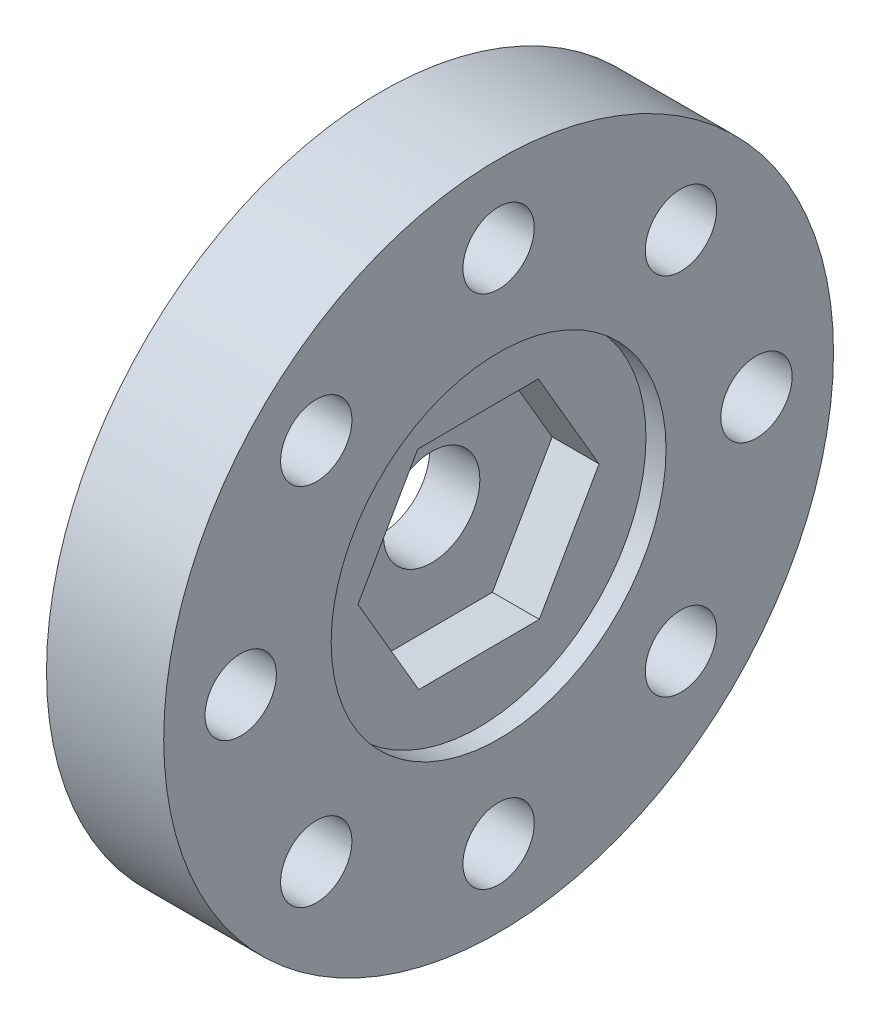
ISO-10303-21;
HEADER;
FILE_DESCRIPTION(('STEP AP214'),'2;1');
FILE_NAME('part.step','',(''),(''),'','','');
FILE_SCHEMA(('AUTOMOTIVE_DESIGN { 1 0 10303 214 1 1 1 1 }'));
ENDSEC;
DATA;
#1=APPLICATION_CONTEXT('core data for automotive mechanical design processes');
#2=APPLICATION_PROTOCOL_DEFINITION('international standard','automotive_design',2000,#1);
#3=PRODUCT_CONTEXT('',#1,'mechanical');
#4=PRODUCT('Part','Part','',(#3));
#5=PRODUCT_RELATED_PRODUCT_CATEGORY('part','',(#4));
#6=PRODUCT_DEFINITION_FORMATION('','',#4);
#7=PRODUCT_DEFINITION_CONTEXT('part definition',#1,'design');
#8=PRODUCT_DEFINITION('design','',#6,#7);
#9=PRODUCT_DEFINITION_SHAPE('','',#8);
#10=(LENGTH_UNIT() NAMED_UNIT(*) SI_UNIT(.MILLI.,.METRE.));
#11=(NAMED_UNIT(*) PLANE_ANGLE_UNIT() SI_UNIT($,.RADIAN.));
#12=(NAMED_UNIT(*) SI_UNIT($,.STERADIAN.) SOLID_ANGLE_UNIT());
#13=UNCERTAINTY_MEASURE_WITH_UNIT(LENGTH_MEASURE(1.E-05),#10,'distance_accuracy_value','');
#14=(GEOMETRIC_REPRESENTATION_CONTEXT(3) GLOBAL_UNCERTAINTY_ASSIGNED_CONTEXT((#13)) GLOBAL_UNIT_ASSIGNED_CONTEXT((#10,
#11,#12)) REPRESENTATION_CONTEXT('',''));
#15=CARTESIAN_POINT('',(0.,0.,0.));
#16=DIRECTION('',(0.,0.,1.));
#17=DIRECTION('',(1.,0.,0.));
#18=AXIS2_PLACEMENT_3D('',#15,#16,#17);
#19=CARTESIAN_POINT('',(4.445,0.,0.));
#20=DIRECTION('',(1.,0.,0.));
#21=DIRECTION('',(0.,0.,-1.));
#22=AXIS2_PLACEMENT_3D('',#19,#20,#21);
#23=PLANE('',#22);
#24=CARTESIAN_POINT('',(4.445,0.,0.));
#25=DIRECTION('',(1.,0.,0.));
#26=DIRECTION('',(0.,0.,-1.));
#27=AXIS2_PLACEMENT_3D('',#24,#25,#26);
#28=CIRCLE('',#27,6.35);
#29=CARTESIAN_POINT('',(4.445,0.,-6.35));
#30=VERTEX_POINT('',#29);
#31=EDGE_CURVE('E136',#30,#30,#28,.T.);
#32=ORIENTED_EDGE('',*,*,#31,.F.);
#33=EDGE_LOOP('',(#32));
#34=FACE_BOUND('',#33,.T.);
#35=CARTESIAN_POINT('',(4.445,-4.16903844779881E-13,9.77899999999958));
#36=DIRECTION('',(1.,0.,0.));
#37=DIRECTION('',(0.,0.,-1.));
#38=AXIS2_PLACEMENT_3D('',#35,#36,#37);
#39=CIRCLE('',#38,1.35255000000062);
#40=CARTESIAN_POINT('',(4.445,-4.16903844779881E-13,8.42644999999897));
#41=VERTEX_POINT('',#40);
#42=EDGE_CURVE('E154',#41,#41,#39,.T.);
#43=ORIENTED_EDGE('',*,*,#42,.F.);
#44=EDGE_LOOP('',(#43));
#45=FACE_BOUND('',#44,.T.);
#46=CARTESIAN_POINT('',(4.445,-9.779,-8.31770244680021E-13));
#47=DIRECTION('',(1.,0.,0.));
#48=DIRECTION('',(0.,0.,-1.));
#49=AXIS2_PLACEMENT_3D('',#46,#47,#48);
#50=CIRCLE('',#49,1.35255000000086);
#51=CARTESIAN_POINT('',(4.445,-9.779,-1.35255000000169));
#52=VERTEX_POINT('',#51);
#53=EDGE_CURVE('E166',#52,#52,#50,.T.);
#54=ORIENTED_EDGE('',*,*,#53,.F.);
#55=EDGE_LOOP('',(#54));
#56=FACE_BOUND('',#55,.T.);
#57=CARTESIAN_POINT('',(4.445,4.15706262674995E-13,-9.77900000000041));
#58=DIRECTION('',(1.,0.,0.));
#59=DIRECTION('',(0.,0.,-1.));
#60=AXIS2_PLACEMENT_3D('',#57,#58,#59);
#61=CIRCLE('',#60,1.35255000000031);
#62=CARTESIAN_POINT('',(4.445,4.15706262674995E-13,-11.1315500000007));
#63=VERTEX_POINT('',#62);
#64=EDGE_CURVE('E178',#63,#63,#61,.T.);
#65=ORIENTED_EDGE('',*,*,#64,.F.);
#66=EDGE_LOOP('',(#65));
#67=FACE_BOUND('',#66,.T.);
#68=CARTESIAN_POINT('',(4.445,9.779,0.));
#69=DIRECTION('',(1.,0.,0.));
#70=DIRECTION('',(0.,0.,-1.));
#71=AXIS2_PLACEMENT_3D('',#68,#69,#70);
#72=CIRCLE('',#71,1.35255);
#73=CARTESIAN_POINT('',(4.445,9.779,-1.35255));
#74=VERTEX_POINT('',#73);
#75=EDGE_CURVE('E190',#74,#74,#72,.T.);
#76=ORIENTED_EDGE('',*,*,#75,.F.);
#77=EDGE_LOOP('',(#76));
#78=FACE_BOUND('',#77,.T.);
#79=CARTESIAN_POINT('',(4.445,0.,0.));
#80=DIRECTION('',(1.,0.,0.));
#81=DIRECTION('',(0.,0.,-1.));
#82=AXIS2_PLACEMENT_3D('',#79,#80,#81);
#83=CIRCLE('',#82,12.7);
#84=CARTESIAN_POINT('',(4.445,0.,-12.7));
#85=VERTEX_POINT('',#84);
#86=EDGE_CURVE('E11',#85,#85,#83,.T.);
#87=ORIENTED_EDGE('',*,*,#86,.T.);
#88=EDGE_LOOP('',(#87));
#89=FACE_BOUND('',#88,.T.);
#90=CARTESIAN_POINT('',(4.445,6.91479721322354,-6.91479721322337));
#91=DIRECTION('',(1.,0.,0.));
#92=DIRECTION('',(0.,0.,-1.));
#93=AXIS2_PLACEMENT_3D('',#90,#91,#92);
#94=CIRCLE('',#93,1.35255000000005);
#95=CARTESIAN_POINT('',(4.445,6.91479721322354,-8.26734721322342));
#96=VERTEX_POINT('',#95);
#97=EDGE_CURVE('E184',#96,#96,#94,.T.);
#98=ORIENTED_EDGE('',*,*,#97,.F.);
#99=EDGE_LOOP('',(#98));
#100=FACE_BOUND('',#99,.T.);
#101=CARTESIAN_POINT('',(4.445,-6.91479721322295,-6.91479721322396));
#102=DIRECTION('',(1.,0.,0.));
#103=DIRECTION('',(0.,0.,-1.));
#104=AXIS2_PLACEMENT_3D('',#101,#102,#103);
#105=CIRCLE('',#104,1.35255000000064);
#106=CARTESIAN_POINT('',(4.445,-6.91479721322295,-8.2673472132246));
#107=VERTEX_POINT('',#106);
#108=EDGE_CURVE('E172',#107,#107,#105,.T.);
#109=ORIENTED_EDGE('',*,*,#108,.F.);
#110=EDGE_LOOP('',(#109));
#111=FACE_BOUND('',#110,.T.);
#112=CARTESIAN_POINT('',(4.445,-6.91479721322354,6.91479721322254));
#113=DIRECTION('',(1.,0.,0.));
#114=DIRECTION('',(0.,0.,-1.));
#115=AXIS2_PLACEMENT_3D('',#112,#113,#114);
#116=CIRCLE('',#115,1.35255000000085);
#117=CARTESIAN_POINT('',(4.445,-6.91479721322354,5.56224721322169));
#118=VERTEX_POINT('',#117);
#119=EDGE_CURVE('E160',#118,#118,#116,.T.);
#120=ORIENTED_EDGE('',*,*,#119,.F.);
#121=EDGE_LOOP('',(#120));
#122=FACE_BOUND('',#121,.T.);
#123=CARTESIAN_POINT('',(4.445,6.91479721322295,6.91479721322313));
#124=DIRECTION('',(1.,0.,0.));
#125=DIRECTION('',(0.,0.,-1.));
#126=AXIS2_PLACEMENT_3D('',#123,#124,#125);
#127=CIRCLE('',#126,1.35255000000032);
#128=CARTESIAN_POINT('',(4.445,6.91479721322295,5.56224721322281));
#129=VERTEX_POINT('',#128);
#130=EDGE_CURVE('E148',#129,#129,#127,.T.);
#131=ORIENTED_EDGE('',*,*,#130,.F.);
#132=EDGE_LOOP('',(#131));
#133=FACE_BOUND('',#132,.T.);
#134=ADVANCED_FACE('F33',(#34,#45,#56,#67,#78,#89,#100,#111,#122,#133),#23,.T.);
#135=CARTESIAN_POINT('',(0.,0.,0.));
#136=DIRECTION('',(1.,0.,0.));
#137=DIRECTION('',(0.,0.,-1.));
#138=AXIS2_PLACEMENT_3D('',#135,#136,#137);
#139=PLANE('',#138);
#140=CARTESIAN_POINT('',(0.,0.,0.));
#141=DIRECTION('',(1.,0.,0.));
#142=DIRECTION('',(0.,0.,-1.));
#143=AXIS2_PLACEMENT_3D('',#140,#141,#142);
#144=CIRCLE('',#143,1.8288);
#145=CARTESIAN_POINT('',(0.,0.,-1.8288));
#146=VERTEX_POINT('',#145);
#147=EDGE_CURVE('E123',#146,#146,#144,.T.);
#148=ORIENTED_EDGE('',*,*,#147,.T.);
#149=EDGE_LOOP('',(#148));
#150=FACE_BOUND('',#149,.T.);
#151=CARTESIAN_POINT('',(0.,-4.16903844779881E-13,9.77899999999958));
#152=DIRECTION('',(1.,0.,0.));
#153=DIRECTION('',(0.,0.,-1.));
#154=AXIS2_PLACEMENT_3D('',#151,#152,#153);
#155=CIRCLE('',#154,1.35255000000062);
#156=CARTESIAN_POINT('',(0.,-4.16903844779881E-13,8.42644999999897));
#157=VERTEX_POINT('',#156);
#158=EDGE_CURVE('E151',#157,#157,#155,.T.);
#159=ORIENTED_EDGE('',*,*,#158,.T.);
#160=EDGE_LOOP('',(#159));
#161=FACE_BOUND('',#160,.T.);
#162=CARTESIAN_POINT('',(0.,-9.779,-8.31770244680021E-13));
#163=DIRECTION('',(1.,0.,0.));
#164=DIRECTION('',(0.,0.,-1.));
#165=AXIS2_PLACEMENT_3D('',#162,#163,#164);
#166=CIRCLE('',#165,1.35255000000086);
#167=CARTESIAN_POINT('',(0.,-9.779,-1.35255000000169));
#168=VERTEX_POINT('',#167);
#169=EDGE_CURVE('E163',#168,#168,#166,.T.);
#170=ORIENTED_EDGE('',*,*,#169,.T.);
#171=EDGE_LOOP('',(#170));
#172=FACE_BOUND('',#171,.T.);
#173=CARTESIAN_POINT('',(0.,4.15706262674995E-13,-9.77900000000041));
#174=DIRECTION('',(1.,0.,0.));
#175=DIRECTION('',(0.,0.,-1.));
#176=AXIS2_PLACEMENT_3D('',#173,#174,#175);
#177=CIRCLE('',#176,1.35255000000031);
#178=CARTESIAN_POINT('',(0.,4.15706262674995E-13,-11.1315500000007));
#179=VERTEX_POINT('',#178);
#180=EDGE_CURVE('E175',#179,#179,#177,.T.);
#181=ORIENTED_EDGE('',*,*,#180,.T.);
#182=EDGE_LOOP('',(#181));
#183=FACE_BOUND('',#182,.T.);
#184=CARTESIAN_POINT('',(0.,9.779,0.));
#185=DIRECTION('',(1.,0.,0.));
#186=DIRECTION('',(0.,0.,-1.));
#187=AXIS2_PLACEMENT_3D('',#184,#185,#186);
#188=CIRCLE('',#187,1.35255);
#189=CARTESIAN_POINT('',(0.,9.779,-1.35255));
#190=VERTEX_POINT('',#189);
#191=EDGE_CURVE('E187',#190,#190,#188,.T.);
#192=ORIENTED_EDGE('',*,*,#191,.T.);
#193=EDGE_LOOP('',(#192));
#194=FACE_BOUND('',#193,.T.);
#195=CARTESIAN_POINT('',(0.,0.,0.));
#196=DIRECTION('',(1.,0.,0.));
#197=DIRECTION('',(0.,0.,-1.));
#198=AXIS2_PLACEMENT_3D('',#195,#196,#197);
#199=CIRCLE('',#198,12.7);
#200=CARTESIAN_POINT('',(0.,0.,-12.7));
#201=VERTEX_POINT('',#200);
#202=EDGE_CURVE('E37',#201,#201,#199,.T.);
#203=ORIENTED_EDGE('',*,*,#202,.F.);
#204=EDGE_LOOP('',(#203));
#205=FACE_BOUND('',#204,.T.);
#206=CARTESIAN_POINT('',(0.,6.91479721322354,-6.91479721322337));
#207=DIRECTION('',(1.,0.,0.));
#208=DIRECTION('',(0.,0.,-1.));
#209=AXIS2_PLACEMENT_3D('',#206,#207,#208);
#210=CIRCLE('',#209,1.35255000000005);
#211=CARTESIAN_POINT('',(0.,6.91479721322354,-8.26734721322342));
#212=VERTEX_POINT('',#211);
#213=EDGE_CURVE('E181',#212,#212,#210,.T.);
#214=ORIENTED_EDGE('',*,*,#213,.T.);
#215=EDGE_LOOP('',(#214));
#216=FACE_BOUND('',#215,.T.);
#217=CARTESIAN_POINT('',(0.,-6.91479721322295,-6.91479721322396));
#218=DIRECTION('',(1.,0.,0.));
#219=DIRECTION('',(0.,0.,-1.));
#220=AXIS2_PLACEMENT_3D('',#217,#218,#219);
#221=CIRCLE('',#220,1.35255000000064);
#222=CARTESIAN_POINT('',(0.,-6.91479721322295,-8.2673472132246));
#223=VERTEX_POINT('',#222);
#224=EDGE_CURVE('E169',#223,#223,#221,.T.);
#225=ORIENTED_EDGE('',*,*,#224,.T.);
#226=EDGE_LOOP('',(#225));
#227=FACE_BOUND('',#226,.T.);
#228=CARTESIAN_POINT('',(0.,-6.91479721322354,6.91479721322254));
#229=DIRECTION('',(1.,0.,0.));
#230=DIRECTION('',(0.,0.,-1.));
#231=AXIS2_PLACEMENT_3D('',#228,#229,#230);
#232=CIRCLE('',#231,1.35255000000085);
#233=CARTESIAN_POINT('',(0.,-6.91479721322354,5.56224721322169));
#234=VERTEX_POINT('',#233);
#235=EDGE_CURVE('E157',#234,#234,#232,.T.);
#236=ORIENTED_EDGE('',*,*,#235,.T.);
#237=EDGE_LOOP('',(#236));
#238=FACE_BOUND('',#237,.T.);
#239=CARTESIAN_POINT('',(0.,6.91479721322295,6.91479721322313));
#240=DIRECTION('',(1.,0.,0.));
#241=DIRECTION('',(0.,0.,-1.));
#242=AXIS2_PLACEMENT_3D('',#239,#240,#241);
#243=CIRCLE('',#242,1.35255000000032);
#244=CARTESIAN_POINT('',(0.,6.91479721322295,5.56224721322281));
#245=VERTEX_POINT('',#244);
#246=EDGE_CURVE('E145',#245,#245,#243,.T.);
#247=ORIENTED_EDGE('',*,*,#246,.T.);
#248=EDGE_LOOP('',(#247));
#249=FACE_BOUND('',#248,.T.);
#250=ADVANCED_FACE('F196',(#150,#161,#172,#183,#194,#205,#216,#227,#238,#249),#139,.F.);
#251=CARTESIAN_POINT('',(4.445,0.,0.));
#252=DIRECTION('',(-1.,0.,0.));
#253=DIRECTION('',(0.,0.,1.));
#254=AXIS2_PLACEMENT_3D('',#251,#252,#253);
#255=CYLINDRICAL_SURFACE('',#254,12.7);
#256=ORIENTED_EDGE('',*,*,#86,.F.);
#257=EDGE_LOOP('',(#256));
#258=FACE_BOUND('',#257,.T.);
#259=ORIENTED_EDGE('',*,*,#202,.T.);
#260=EDGE_LOOP('',(#259));
#261=FACE_BOUND('',#260,.T.);
#262=ADVANCED_FACE('F35',(#258,#261),#255,.T.);
#263=CARTESIAN_POINT('',(4.445,9.779,0.));
#264=DIRECTION('',(-1.,0.,0.));
#265=DIRECTION('',(0.,0.,1.));
#266=AXIS2_PLACEMENT_3D('',#263,#264,#265);
#267=CYLINDRICAL_SURFACE('',#266,1.35255);
#268=ORIENTED_EDGE('',*,*,#75,.T.);
#269=EDGE_LOOP('',(#268));
#270=FACE_BOUND('',#269,.T.);
#271=ORIENTED_EDGE('',*,*,#191,.F.);
#272=EDGE_LOOP('',(#271));
#273=FACE_BOUND('',#272,.T.);
#274=ADVANCED_FACE('F199',(#270,#273),#267,.F.);
#275=CARTESIAN_POINT('',(4.445,6.91479721322354,-6.91479721322337));
#276=DIRECTION('',(-1.,0.,0.));
#277=DIRECTION('',(0.,0.,1.));
#278=AXIS2_PLACEMENT_3D('',#275,#276,#277);
#279=CYLINDRICAL_SURFACE('',#278,1.35255000000005);
#280=ORIENTED_EDGE('',*,*,#97,.T.);
#281=EDGE_LOOP('',(#280));
#282=FACE_BOUND('',#281,.T.);
#283=ORIENTED_EDGE('',*,*,#213,.F.);
#284=EDGE_LOOP('',(#283));
#285=FACE_BOUND('',#284,.T.);
#286=ADVANCED_FACE('F201',(#282,#285),#279,.F.);
#287=CARTESIAN_POINT('',(4.445,4.15706262674995E-13,-9.77900000000041));
#288=DIRECTION('',(-1.,0.,0.));
#289=DIRECTION('',(0.,0.,1.));
#290=AXIS2_PLACEMENT_3D('',#287,#288,#289);
#291=CYLINDRICAL_SURFACE('',#290,1.35255000000031);
#292=ORIENTED_EDGE('',*,*,#64,.T.);
#293=EDGE_LOOP('',(#292));
#294=FACE_BOUND('',#293,.T.);
#295=ORIENTED_EDGE('',*,*,#180,.F.);
#296=EDGE_LOOP('',(#295));
#297=FACE_BOUND('',#296,.T.);
#298=ADVANCED_FACE('F208',(#294,#297),#291,.F.);
#299=CARTESIAN_POINT('',(4.445,-6.91479721322295,-6.91479721322396));
#300=DIRECTION('',(-1.,0.,0.));
#301=DIRECTION('',(0.,0.,1.));
#302=AXIS2_PLACEMENT_3D('',#299,#300,#301);
#303=CYLINDRICAL_SURFACE('',#302,1.35255000000064);
#304=ORIENTED_EDGE('',*,*,#108,.T.);
#305=EDGE_LOOP('',(#304));
#306=FACE_BOUND('',#305,.T.);
#307=ORIENTED_EDGE('',*,*,#224,.F.);
#308=EDGE_LOOP('',(#307));
#309=FACE_BOUND('',#308,.T.);
#310=ADVANCED_FACE('F265',(#306,#309),#303,.F.);
#311=CARTESIAN_POINT('',(4.445,-9.779,-8.31770244680021E-13));
#312=DIRECTION('',(-1.,0.,0.));
#313=DIRECTION('',(0.,0.,1.));
#314=AXIS2_PLACEMENT_3D('',#311,#312,#313);
#315=CYLINDRICAL_SURFACE('',#314,1.35255000000086);
#316=ORIENTED_EDGE('',*,*,#53,.T.);
#317=EDGE_LOOP('',(#316));
#318=FACE_BOUND('',#317,.T.);
#319=ORIENTED_EDGE('',*,*,#169,.F.);
#320=EDGE_LOOP('',(#319));
#321=FACE_BOUND('',#320,.T.);
#322=ADVANCED_FACE('F261',(#318,#321),#315,.F.);
#323=CARTESIAN_POINT('',(4.445,-6.91479721322354,6.91479721322254));
#324=DIRECTION('',(-1.,0.,0.));
#325=DIRECTION('',(0.,0.,1.));
#326=AXIS2_PLACEMENT_3D('',#323,#324,#325);
#327=CYLINDRICAL_SURFACE('',#326,1.35255000000085);
#328=ORIENTED_EDGE('',*,*,#119,.T.);
#329=EDGE_LOOP('',(#328));
#330=FACE_BOUND('',#329,.T.);
#331=ORIENTED_EDGE('',*,*,#235,.F.);
#332=EDGE_LOOP('',(#331));
#333=FACE_BOUND('',#332,.T.);
#334=ADVANCED_FACE('F254',(#330,#333),#327,.F.);
#335=CARTESIAN_POINT('',(4.445,-4.16903844779881E-13,9.77899999999958));
#336=DIRECTION('',(-1.,0.,0.));
#337=DIRECTION('',(0.,0.,1.));
#338=AXIS2_PLACEMENT_3D('',#335,#336,#337);
#339=CYLINDRICAL_SURFACE('',#338,1.35255000000062);
#340=ORIENTED_EDGE('',*,*,#42,.T.);
#341=EDGE_LOOP('',(#340));
#342=FACE_BOUND('',#341,.T.);
#343=ORIENTED_EDGE('',*,*,#158,.F.);
#344=EDGE_LOOP('',(#343));
#345=FACE_BOUND('',#344,.T.);
#346=ADVANCED_FACE('F243',(#342,#345),#339,.F.);
#347=CARTESIAN_POINT('',(4.445,6.91479721322295,6.91479721322313));
#348=DIRECTION('',(-1.,0.,0.));
#349=DIRECTION('',(0.,0.,1.));
#350=AXIS2_PLACEMENT_3D('',#347,#348,#349);
#351=CYLINDRICAL_SURFACE('',#350,1.35255000000032);
#352=ORIENTED_EDGE('',*,*,#130,.T.);
#353=EDGE_LOOP('',(#352));
#354=FACE_BOUND('',#353,.T.);
#355=ORIENTED_EDGE('',*,*,#246,.F.);
#356=EDGE_LOOP('',(#355));
#357=FACE_BOUND('',#356,.T.);
#358=ADVANCED_FACE('F239',(#354,#357),#351,.F.);
#359=CARTESIAN_POINT('',(3.683,0.,0.));
#360=DIRECTION('',(1.,0.,0.));
#361=DIRECTION('',(0.,0.,-1.));
#362=AXIS2_PLACEMENT_3D('',#359,#360,#361);
#363=CYLINDRICAL_SURFACE('',#362,6.35);
#364=CARTESIAN_POINT('',(3.683,0.,0.));
#365=DIRECTION('',(1.,0.,0.));
#366=DIRECTION('',(0.,0.,-1.));
#367=AXIS2_PLACEMENT_3D('',#364,#365,#366);
#368=CIRCLE('',#367,6.35);
#369=CARTESIAN_POINT('',(3.683,0.,-6.35));
#370=VERTEX_POINT('',#369);
#371=EDGE_CURVE('E142',#370,#370,#368,.T.);
#372=ORIENTED_EDGE('',*,*,#371,.F.);
#373=EDGE_LOOP('',(#372));
#374=FACE_BOUND('',#373,.T.);
#375=ORIENTED_EDGE('',*,*,#31,.T.);
#376=EDGE_LOOP('',(#375));
#377=FACE_BOUND('',#376,.T.);
#378=ADVANCED_FACE('F242',(#374,#377),#363,.F.);
#379=CARTESIAN_POINT('',(3.683,0.,0.));
#380=DIRECTION('',(1.,0.,0.));
#381=DIRECTION('',(0.,0.,-1.));
#382=AXIS2_PLACEMENT_3D('',#379,#380,#381);
#383=PLANE('',#382);
#384=DIRECTION('',(0.,-0.00496429053464109,0.999987677833826));
#385=VECTOR('',#384,1.);
#386=CARTESIAN_POINT('',(3.683,3.97076772504019,-2.26631588128822));
#387=LINE('',#386,#385);
#388=CARTESIAN_POINT('',(3.683,3.97076772504019,-2.26631588128822));
#389=VERTEX_POINT('',#388);
#390=CARTESIAN_POINT('',(3.683,3.94807098871581,2.30562778176804));
#391=VERTEX_POINT('',#390);
#392=EDGE_CURVE('E48',#389,#391,#387,.T.);
#393=ORIENTED_EDGE('',*,*,#392,.F.);
#394=DIRECTION('',(0.,0.863532587208182,0.504293040631678));
#395=VECTOR('',#394,1.);
#396=CARTESIAN_POINT('',(3.683,0.0226967363243776,-4.57194366305625));
#397=LINE('',#396,#395);
#398=CARTESIAN_POINT('',(3.683,0.0226967363243776,-4.57194366305625));
#399=VERTEX_POINT('',#398);
#400=EDGE_CURVE('E132',#399,#389,#397,.T.);
#401=ORIENTED_EDGE('',*,*,#400,.F.);
#402=DIRECTION('',(0.,0.868496877742823,-0.495694637202147));
#403=VECTOR('',#402,1.);
#404=CARTESIAN_POINT('',(3.683,-3.94807098871581,-2.30562778176804));
#405=LINE('',#404,#403);
#406=CARTESIAN_POINT('',(3.683,-3.94807098871581,-2.30562778176804));
#407=VERTEX_POINT('',#406);
#408=EDGE_CURVE('E130',#407,#399,#405,.T.);
#409=ORIENTED_EDGE('',*,*,#408,.F.);
#410=DIRECTION('',(0.,0.00496429053464128,-0.999987677833826));
#411=VECTOR('',#410,1.);
#412=CARTESIAN_POINT('',(3.683,-3.97076772504019,2.26631588128822));
#413=LINE('',#412,#411);
#414=CARTESIAN_POINT('',(3.683,-3.97076772504019,2.26631588128822));
#415=VERTEX_POINT('',#414);
#416=EDGE_CURVE('E96',#415,#407,#413,.T.);
#417=ORIENTED_EDGE('',*,*,#416,.F.);
#418=DIRECTION('',(0.,-0.863532587208182,-0.504293040631679));
#419=VECTOR('',#418,1.);
#420=CARTESIAN_POINT('',(3.683,-0.0226967363243789,4.57194366305625));
#421=LINE('',#420,#419);
#422=CARTESIAN_POINT('',(3.683,-0.0226967363243789,4.57194366305625));
#423=VERTEX_POINT('',#422);
#424=EDGE_CURVE('E126',#423,#415,#421,.T.);
#425=ORIENTED_EDGE('',*,*,#424,.F.);
#426=DIRECTION('',(0.,-0.868496877742823,0.495694637202147));
#427=VECTOR('',#426,1.);
#428=CARTESIAN_POINT('',(3.683,3.94807098871581,2.30562778176804));
#429=LINE('',#428,#427);
#430=EDGE_CURVE('E122',#391,#423,#429,.T.);
#431=ORIENTED_EDGE('',*,*,#430,.F.);
#432=EDGE_LOOP('',(#393,#401,#409,#417,#425,#431));
#433=FACE_BOUND('',#432,.T.);
#434=ORIENTED_EDGE('',*,*,#371,.T.);
#435=EDGE_LOOP('',(#434));
#436=FACE_BOUND('',#435,.T.);
#437=ADVANCED_FACE('F251',(#433,#436),#383,.T.);
#438=CARTESIAN_POINT('',(1.905,3.97076772504019,-2.26631588128822));
#439=DIRECTION('',(0.,0.999987677833826,0.00496429053464109));
#440=DIRECTION('',(0.,-0.00496429053464109,0.999987677833826));
#441=AXIS2_PLACEMENT_3D('',#438,#439,#440);
#442=PLANE('',#441);
#443=ORIENTED_EDGE('',*,*,#392,.T.);
#444=DIRECTION('',(1.,0.,0.));
#445=VECTOR('',#444,1.);
#446=CARTESIAN_POINT('',(1.905,3.94807098871581,2.30562778176804));
#447=LINE('',#446,#445);
#448=CARTESIAN_POINT('',(1.905,3.94807098871581,2.30562778176804));
#449=VERTEX_POINT('',#448);
#450=EDGE_CURVE('E78',#449,#391,#447,.T.);
#451=ORIENTED_EDGE('',*,*,#450,.F.);
#452=DIRECTION('',(0.,-0.00496429053464109,0.999987677833826));
#453=VECTOR('',#452,1.);
#454=CARTESIAN_POINT('',(1.905,3.97076772504019,-2.26631588128822));
#455=LINE('',#454,#453);
#456=CARTESIAN_POINT('',(1.905,3.97076772504019,-2.26631588128822));
#457=VERTEX_POINT('',#456);
#458=EDGE_CURVE('E134',#457,#449,#455,.T.);
#459=ORIENTED_EDGE('',*,*,#458,.F.);
#460=DIRECTION('',(1.,0.,0.));
#461=VECTOR('',#460,1.);
#462=CARTESIAN_POINT('',(1.905,3.97076772504019,-2.26631588128822));
#463=LINE('',#462,#461);
#464=EDGE_CURVE('E56',#457,#389,#463,.T.);
#465=ORIENTED_EDGE('',*,*,#464,.T.);
#466=EDGE_LOOP('',(#443,#451,#459,#465));
#467=FACE_BOUND('',#466,.T.);
#468=ADVANCED_FACE('F319',(#467),#442,.F.);
#469=CARTESIAN_POINT('',(1.905,0.0226967363243776,-4.57194366305625));
#470=DIRECTION('',(0.,0.504293040631678,-0.863532587208182));
#471=DIRECTION('',(0.,0.863532587208182,0.504293040631678));
#472=AXIS2_PLACEMENT_3D('',#469,#470,#471);
#473=PLANE('',#472);
#474=ORIENTED_EDGE('',*,*,#400,.T.);
#475=ORIENTED_EDGE('',*,*,#464,.F.);
#476=DIRECTION('',(0.,0.863532587208182,0.504293040631678));
#477=VECTOR('',#476,1.);
#478=CARTESIAN_POINT('',(1.905,0.0226967363243776,-4.57194366305625));
#479=LINE('',#478,#477);
#480=CARTESIAN_POINT('',(1.905,0.0226967363243776,-4.57194366305625));
#481=VERTEX_POINT('',#480);
#482=EDGE_CURVE('E108',#481,#457,#479,.T.);
#483=ORIENTED_EDGE('',*,*,#482,.F.);
#484=DIRECTION('',(1.,0.,0.));
#485=VECTOR('',#484,1.);
#486=CARTESIAN_POINT('',(1.905,0.0226967363243776,-4.57194366305625));
#487=LINE('',#486,#485);
#488=EDGE_CURVE('E100',#481,#399,#487,.T.);
#489=ORIENTED_EDGE('',*,*,#488,.T.);
#490=EDGE_LOOP('',(#474,#475,#483,#489));
#491=FACE_BOUND('',#490,.T.);
#492=ADVANCED_FACE('F328',(#491),#473,.F.);
#493=CARTESIAN_POINT('',(1.905,-3.94807098871581,-2.30562778176804));
#494=DIRECTION('',(0.,-0.495694637202147,-0.868496877742823));
#495=DIRECTION('',(0.,0.868496877742823,-0.495694637202147));
#496=AXIS2_PLACEMENT_3D('',#493,#494,#495);
#497=PLANE('',#496);
#498=ORIENTED_EDGE('',*,*,#408,.T.);
#499=ORIENTED_EDGE('',*,*,#488,.F.);
#500=DIRECTION('',(0.,0.868496877742823,-0.495694637202147));
#501=VECTOR('',#500,1.);
#502=CARTESIAN_POINT('',(1.905,-3.94807098871581,-2.30562778176804));
#503=LINE('',#502,#501);
#504=CARTESIAN_POINT('',(1.905,-3.94807098871581,-2.30562778176804));
#505=VERTEX_POINT('',#504);
#506=EDGE_CURVE('E104',#505,#481,#503,.T.);
#507=ORIENTED_EDGE('',*,*,#506,.F.);
#508=DIRECTION('',(1.,0.,0.));
#509=VECTOR('',#508,1.);
#510=CARTESIAN_POINT('',(1.905,-3.94807098871581,-2.30562778176804));
#511=LINE('',#510,#509);
#512=EDGE_CURVE('E89',#505,#407,#511,.T.);
#513=ORIENTED_EDGE('',*,*,#512,.T.);
#514=EDGE_LOOP('',(#498,#499,#507,#513));
#515=FACE_BOUND('',#514,.T.);
#516=ADVANCED_FACE('F105',(#515),#497,.F.);
#517=CARTESIAN_POINT('',(1.905,-3.97076772504019,2.26631588128822));
#518=DIRECTION('',(0.,-0.999987677833826,-0.00496429053464128));
#519=DIRECTION('',(0.,0.00496429053464128,-0.999987677833826));
#520=AXIS2_PLACEMENT_3D('',#517,#518,#519);
#521=PLANE('',#520);
#522=ORIENTED_EDGE('',*,*,#416,.T.);
#523=ORIENTED_EDGE('',*,*,#512,.F.);
#524=DIRECTION('',(0.,0.00496429053464128,-0.999987677833826));
#525=VECTOR('',#524,1.);
#526=CARTESIAN_POINT('',(1.905,-3.97076772504019,2.26631588128822));
#527=LINE('',#526,#525);
#528=CARTESIAN_POINT('',(1.905,-3.97076772504019,2.26631588128822));
#529=VERTEX_POINT('',#528);
#530=EDGE_CURVE('E93',#529,#505,#527,.T.);
#531=ORIENTED_EDGE('',*,*,#530,.F.);
#532=DIRECTION('',(1.,0.,0.));
#533=VECTOR('',#532,1.);
#534=CARTESIAN_POINT('',(1.905,-3.97076772504019,2.26631588128822));
#535=LINE('',#534,#533);
#536=EDGE_CURVE('E101',#529,#415,#535,.T.);
#537=ORIENTED_EDGE('',*,*,#536,.T.);
#538=EDGE_LOOP('',(#522,#523,#531,#537));
#539=FACE_BOUND('',#538,.T.);
#540=ADVANCED_FACE('F91',(#539),#521,.F.);
#541=CARTESIAN_POINT('',(1.905,-0.0226967363243789,4.57194366305625));
#542=DIRECTION('',(0.,-0.504293040631679,0.863532587208182));
#543=DIRECTION('',(0.,-0.863532587208182,-0.504293040631679));
#544=AXIS2_PLACEMENT_3D('',#541,#542,#543);
#545=PLANE('',#544);
#546=ORIENTED_EDGE('',*,*,#424,.T.);
#547=ORIENTED_EDGE('',*,*,#536,.F.);
#548=DIRECTION('',(0.,-0.863532587208182,-0.504293040631679));
#549=VECTOR('',#548,1.);
#550=CARTESIAN_POINT('',(1.905,-0.0226967363243789,4.57194366305625));
#551=LINE('',#550,#549);
#552=CARTESIAN_POINT('',(1.905,-0.0226967363243789,4.57194366305625));
#553=VERTEX_POINT('',#552);
#554=EDGE_CURVE('E114',#553,#529,#551,.T.);
#555=ORIENTED_EDGE('',*,*,#554,.F.);
#556=DIRECTION('',(1.,0.,0.));
#557=VECTOR('',#556,1.);
#558=CARTESIAN_POINT('',(1.905,-0.0226967363243789,4.57194366305625));
#559=LINE('',#558,#557);
#560=EDGE_CURVE('E139',#553,#423,#559,.T.);
#561=ORIENTED_EDGE('',*,*,#560,.T.);
#562=EDGE_LOOP('',(#546,#547,#555,#561));
#563=FACE_BOUND('',#562,.T.);
#564=ADVANCED_FACE('F353',(#563),#545,.F.);
#565=CARTESIAN_POINT('',(1.905,3.94807098871581,2.30562778176804));
#566=DIRECTION('',(0.,0.495694637202147,0.868496877742823));
#567=DIRECTION('',(0.,-0.868496877742823,0.495694637202147));
#568=AXIS2_PLACEMENT_3D('',#565,#566,#567);
#569=PLANE('',#568);
#570=ORIENTED_EDGE('',*,*,#430,.T.);
#571=ORIENTED_EDGE('',*,*,#560,.F.);
#572=DIRECTION('',(0.,-0.868496877742823,0.495694637202147));
#573=VECTOR('',#572,1.);
#574=CARTESIAN_POINT('',(1.905,3.94807098871581,2.30562778176804));
#575=LINE('',#574,#573);
#576=EDGE_CURVE('E116',#449,#553,#575,.T.);
#577=ORIENTED_EDGE('',*,*,#576,.F.);
#578=ORIENTED_EDGE('',*,*,#450,.T.);
#579=EDGE_LOOP('',(#570,#571,#577,#578));
#580=FACE_BOUND('',#579,.T.);
#581=ADVANCED_FACE('F362',(#580),#569,.F.);
#582=CARTESIAN_POINT('',(1.905,0.,0.));
#583=DIRECTION('',(1.,0.,0.));
#584=DIRECTION('',(0.,0.,-1.));
#585=AXIS2_PLACEMENT_3D('',#582,#583,#584);
#586=PLANE('',#585);
#587=CARTESIAN_POINT('',(1.905,0.,0.));
#588=DIRECTION('',(1.,0.,0.));
#589=DIRECTION('',(0.,0.,-1.));
#590=AXIS2_PLACEMENT_3D('',#587,#588,#589);
#591=CIRCLE('',#590,1.8288);
#592=CARTESIAN_POINT('',(1.905,0.,-1.8288));
#593=VERTEX_POINT('',#592);
#594=EDGE_CURVE('E406',#593,#593,#591,.T.);
#595=ORIENTED_EDGE('',*,*,#594,.F.);
#596=EDGE_LOOP('',(#595));
#597=FACE_BOUND('',#596,.T.);
#598=ORIENTED_EDGE('',*,*,#458,.T.);
#599=ORIENTED_EDGE('',*,*,#576,.T.);
#600=ORIENTED_EDGE('',*,*,#554,.T.);
#601=ORIENTED_EDGE('',*,*,#530,.T.);
#602=ORIENTED_EDGE('',*,*,#506,.T.);
#603=ORIENTED_EDGE('',*,*,#482,.T.);
#604=EDGE_LOOP('',(#598,#599,#600,#601,#602,#603));
#605=FACE_BOUND('',#604,.T.);
#606=ADVANCED_FACE('F111',(#597,#605),#586,.T.);
#607=CARTESIAN_POINT('',(0.,0.,0.));
#608=DIRECTION('',(1.,0.,0.));
#609=DIRECTION('',(0.,0.,-1.));
#610=AXIS2_PLACEMENT_3D('',#607,#608,#609);
#611=CYLINDRICAL_SURFACE('',#610,1.8288);
#612=ORIENTED_EDGE('',*,*,#147,.F.);
#613=EDGE_LOOP('',(#612));
#614=FACE_BOUND('',#613,.T.);
#615=ORIENTED_EDGE('',*,*,#594,.T.);
#616=EDGE_LOOP('',(#615));
#617=FACE_BOUND('',#616,.T.);
#618=ADVANCED_FACE('F387',(#614,#617),#611,.F.);
#619=CLOSED_SHELL('',(#134,#250,#262,#274,#286,#298,#310,#322,#334,#346,#358,#378,#437,#468,
#492,#516,#540,#564,#581,#606,#618));
#620=MANIFOLD_SOLID_BREP('B2',#619);
#621=ADVANCED_BREP_SHAPE_REPRESENTATION('',(#18,#620),#14);
#622=SHAPE_DEFINITION_REPRESENTATION(#9,#621);
ENDSEC;
END-ISO-10303-21;
